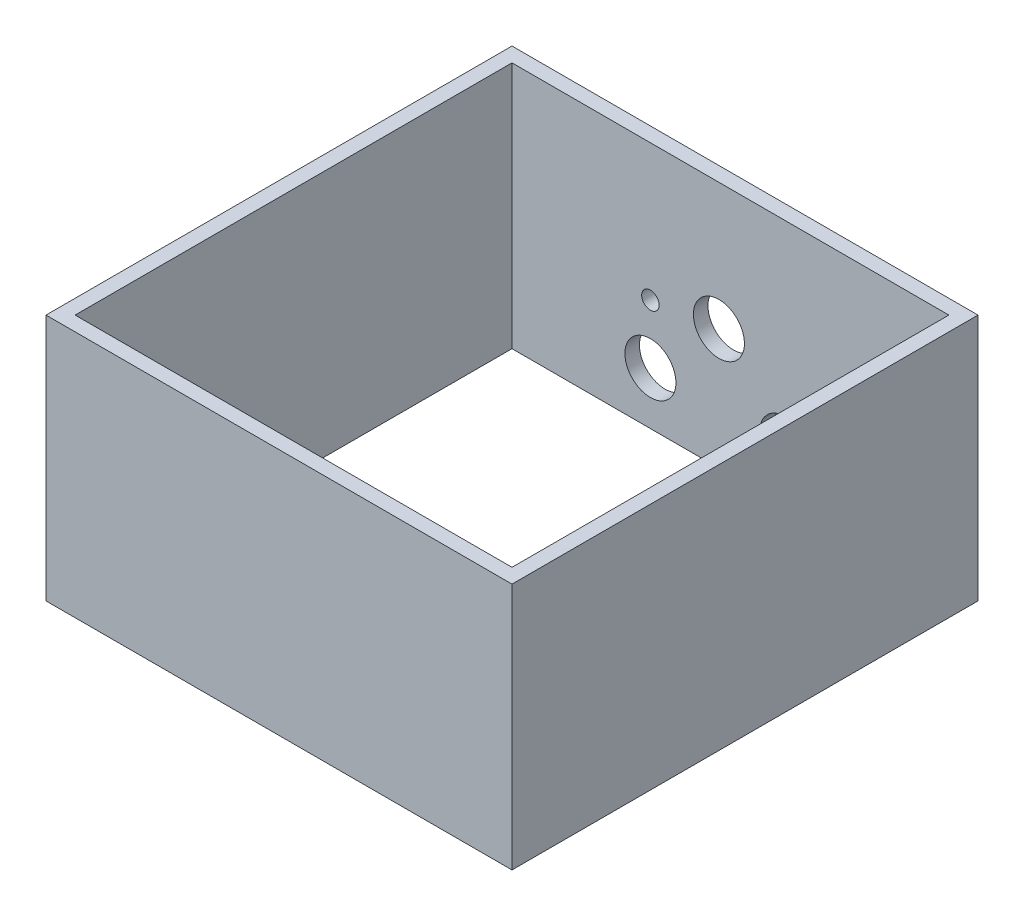
ISO-10303-21;
HEADER;
FILE_DESCRIPTION(('STEP AP214'),'2;1');
FILE_NAME('part.step','',(''),(''),'','','');
FILE_SCHEMA(('AUTOMOTIVE_DESIGN { 1 0 10303 214 1 1 1 1 }'));
ENDSEC;
DATA;
#1=APPLICATION_CONTEXT('core data for automotive mechanical design processes');
#2=APPLICATION_PROTOCOL_DEFINITION('international standard','automotive_design',2000,#1);
#3=PRODUCT_CONTEXT('',#1,'mechanical');
#4=PRODUCT('Part','Part','',(#3));
#5=PRODUCT_RELATED_PRODUCT_CATEGORY('part','',(#4));
#6=PRODUCT_DEFINITION_FORMATION('','',#4);
#7=PRODUCT_DEFINITION_CONTEXT('part definition',#1,'design');
#8=PRODUCT_DEFINITION('design','',#6,#7);
#9=PRODUCT_DEFINITION_SHAPE('','',#8);
#10=(LENGTH_UNIT() NAMED_UNIT(*) SI_UNIT(.MILLI.,.METRE.));
#11=(NAMED_UNIT(*) PLANE_ANGLE_UNIT() SI_UNIT($,.RADIAN.));
#12=(NAMED_UNIT(*) SI_UNIT($,.STERADIAN.) SOLID_ANGLE_UNIT());
#13=UNCERTAINTY_MEASURE_WITH_UNIT(LENGTH_MEASURE(1.E-05),#10,'distance_accuracy_value','');
#14=(GEOMETRIC_REPRESENTATION_CONTEXT(3) GLOBAL_UNCERTAINTY_ASSIGNED_CONTEXT((#13)) GLOBAL_UNIT_ASSIGNED_CONTEXT((#10,
#11,#12)) REPRESENTATION_CONTEXT('',''));
#15=CARTESIAN_POINT('',(0.,0.,0.));
#16=DIRECTION('',(0.,0.,1.));
#17=DIRECTION('',(1.,0.,0.));
#18=AXIS2_PLACEMENT_3D('',#15,#16,#17);
#19=CARTESIAN_POINT('',(0.,53.975,0.));
#20=DIRECTION('',(0.,-1.,0.));
#21=DIRECTION('',(0.,0.,-1.));
#22=AXIS2_PLACEMENT_3D('',#19,#20,#21);
#23=PLANE('',#22);
#24=DIRECTION('',(0.,0.,-1.));
#25=VECTOR('',#24,1.);
#26=CARTESIAN_POINT('',(50.8,53.975,50.8));
#27=LINE('',#26,#25);
#28=CARTESIAN_POINT('',(50.8,53.975,50.8));
#29=VERTEX_POINT('',#28);
#30=CARTESIAN_POINT('',(50.8,53.975,-50.8));
#31=VERTEX_POINT('',#30);
#32=EDGE_CURVE('E136',#29,#31,#27,.T.);
#33=ORIENTED_EDGE('',*,*,#32,.T.);
#34=DIRECTION('',(-1.,0.,0.));
#35=VECTOR('',#34,1.);
#36=CARTESIAN_POINT('',(-50.8,53.975,-50.8));
#37=LINE('',#36,#35);
#38=CARTESIAN_POINT('',(-50.8,53.975,-50.8));
#39=VERTEX_POINT('',#38);
#40=EDGE_CURVE('E139',#31,#39,#37,.T.);
#41=ORIENTED_EDGE('',*,*,#40,.T.);
#42=DIRECTION('',(0.,0.,1.));
#43=VECTOR('',#42,1.);
#44=CARTESIAN_POINT('',(-50.8,53.975,50.8));
#45=LINE('',#44,#43);
#46=CARTESIAN_POINT('',(-50.8,53.975,50.8));
#47=VERTEX_POINT('',#46);
#48=EDGE_CURVE('E142',#39,#47,#45,.T.);
#49=ORIENTED_EDGE('',*,*,#48,.T.);
#50=DIRECTION('',(1.,0.,0.));
#51=VECTOR('',#50,1.);
#52=CARTESIAN_POINT('',(-50.8,53.975,50.8));
#53=LINE('',#52,#51);
#54=EDGE_CURVE('E144',#47,#29,#53,.T.);
#55=ORIENTED_EDGE('',*,*,#54,.T.);
#56=EDGE_LOOP('',(#33,#41,#49,#55));
#57=FACE_BOUND('',#56,.T.);
#58=DIRECTION('',(0.,0.,1.));
#59=VECTOR('',#58,1.);
#60=CARTESIAN_POINT('',(-47.625,53.975,47.625));
#61=LINE('',#60,#59);
#62=CARTESIAN_POINT('',(-47.625,53.975,-47.625));
#63=VERTEX_POINT('',#62);
#64=CARTESIAN_POINT('',(-47.625,53.975,47.625));
#65=VERTEX_POINT('',#64);
#66=EDGE_CURVE('E98',#63,#65,#61,.T.);
#67=ORIENTED_EDGE('',*,*,#66,.F.);
#68=DIRECTION('',(-1.,0.,0.));
#69=VECTOR('',#68,1.);
#70=CARTESIAN_POINT('',(-47.625,53.975,-47.625));
#71=LINE('',#70,#69);
#72=CARTESIAN_POINT('',(47.625,53.975,-47.625));
#73=VERTEX_POINT('',#72);
#74=EDGE_CURVE('E120',#73,#63,#71,.T.);
#75=ORIENTED_EDGE('',*,*,#74,.F.);
#76=DIRECTION('',(0.,0.,-1.));
#77=VECTOR('',#76,1.);
#78=CARTESIAN_POINT('',(47.625,53.975,47.625));
#79=LINE('',#78,#77);
#80=CARTESIAN_POINT('',(47.625,53.975,47.625));
#81=VERTEX_POINT('',#80);
#82=EDGE_CURVE('E118',#81,#73,#79,.T.);
#83=ORIENTED_EDGE('',*,*,#82,.F.);
#84=DIRECTION('',(1.,0.,0.));
#85=VECTOR('',#84,1.);
#86=CARTESIAN_POINT('',(-47.625,53.975,47.625));
#87=LINE('',#86,#85);
#88=EDGE_CURVE('E106',#65,#81,#87,.T.);
#89=ORIENTED_EDGE('',*,*,#88,.F.);
#90=EDGE_LOOP('',(#67,#75,#83,#89));
#91=FACE_BOUND('',#90,.T.);
#92=ADVANCED_FACE('F33',(#57,#91),#23,.F.);
#93=CARTESIAN_POINT('',(0.,0.,0.));
#94=DIRECTION('',(0.,-1.,0.));
#95=DIRECTION('',(0.,0.,-1.));
#96=AXIS2_PLACEMENT_3D('',#93,#94,#95);
#97=PLANE('',#96);
#98=DIRECTION('',(0.,0.,-1.));
#99=VECTOR('',#98,1.);
#100=CARTESIAN_POINT('',(50.8,0.,50.8));
#101=LINE('',#100,#99);
#102=CARTESIAN_POINT('',(50.8,0.,50.8));
#103=VERTEX_POINT('',#102);
#104=CARTESIAN_POINT('',(50.8,0.,-50.8));
#105=VERTEX_POINT('',#104);
#106=EDGE_CURVE('E114',#103,#105,#101,.T.);
#107=ORIENTED_EDGE('',*,*,#106,.F.);
#108=DIRECTION('',(1.,0.,0.));
#109=VECTOR('',#108,1.);
#110=CARTESIAN_POINT('',(-50.8,0.,50.8));
#111=LINE('',#110,#109);
#112=CARTESIAN_POINT('',(-50.8,0.,50.8));
#113=VERTEX_POINT('',#112);
#114=EDGE_CURVE('E140',#113,#103,#111,.T.);
#115=ORIENTED_EDGE('',*,*,#114,.F.);
#116=DIRECTION('',(0.,0.,1.));
#117=VECTOR('',#116,1.);
#118=CARTESIAN_POINT('',(-50.8,0.,50.8));
#119=LINE('',#118,#117);
#120=CARTESIAN_POINT('',(-50.8,0.,-50.8));
#121=VERTEX_POINT('',#120);
#122=EDGE_CURVE('E151',#121,#113,#119,.T.);
#123=ORIENTED_EDGE('',*,*,#122,.F.);
#124=DIRECTION('',(-1.,0.,0.));
#125=VECTOR('',#124,1.);
#126=CARTESIAN_POINT('',(-50.8,0.,-50.8));
#127=LINE('',#126,#125);
#128=EDGE_CURVE('E149',#105,#121,#127,.T.);
#129=ORIENTED_EDGE('',*,*,#128,.F.);
#130=EDGE_LOOP('',(#107,#115,#123,#129));
#131=FACE_BOUND('',#130,.T.);
#132=DIRECTION('',(-1.,0.,0.));
#133=VECTOR('',#132,1.);
#134=CARTESIAN_POINT('',(-47.625,0.,-47.625));
#135=LINE('',#134,#133);
#136=CARTESIAN_POINT('',(47.625,0.,-47.625));
#137=VERTEX_POINT('',#136);
#138=CARTESIAN_POINT('',(-47.625,0.,-47.625));
#139=VERTEX_POINT('',#138);
#140=EDGE_CURVE('E107',#137,#139,#135,.T.);
#141=ORIENTED_EDGE('',*,*,#140,.T.);
#142=DIRECTION('',(0.,0.,1.));
#143=VECTOR('',#142,1.);
#144=CARTESIAN_POINT('',(-47.625,0.,47.625));
#145=LINE('',#144,#143);
#146=CARTESIAN_POINT('',(-47.625,0.,47.625));
#147=VERTEX_POINT('',#146);
#148=EDGE_CURVE('E56',#139,#147,#145,.T.);
#149=ORIENTED_EDGE('',*,*,#148,.T.);
#150=DIRECTION('',(1.,0.,0.));
#151=VECTOR('',#150,1.);
#152=CARTESIAN_POINT('',(-47.625,0.,47.625));
#153=LINE('',#152,#151);
#154=CARTESIAN_POINT('',(47.625,0.,47.625));
#155=VERTEX_POINT('',#154);
#156=EDGE_CURVE('E113',#147,#155,#153,.T.);
#157=ORIENTED_EDGE('',*,*,#156,.T.);
#158=DIRECTION('',(0.,0.,-1.));
#159=VECTOR('',#158,1.);
#160=CARTESIAN_POINT('',(47.625,0.,47.625));
#161=LINE('',#160,#159);
#162=EDGE_CURVE('E128',#155,#137,#161,.T.);
#163=ORIENTED_EDGE('',*,*,#162,.T.);
#164=EDGE_LOOP('',(#141,#149,#157,#163));
#165=FACE_BOUND('',#164,.T.);
#166=ADVANCED_FACE('F169',(#131,#165),#97,.T.);
#167=CARTESIAN_POINT('',(50.8,53.975,50.8));
#168=DIRECTION('',(-1.,0.,0.));
#169=DIRECTION('',(0.,0.,1.));
#170=AXIS2_PLACEMENT_3D('',#167,#168,#169);
#171=PLANE('',#170);
#172=ORIENTED_EDGE('',*,*,#106,.T.);
#173=DIRECTION('',(0.,-1.,0.));
#174=VECTOR('',#173,1.);
#175=CARTESIAN_POINT('',(50.8,53.975,-50.8));
#176=LINE('',#175,#174);
#177=EDGE_CURVE('E11',#31,#105,#176,.T.);
#178=ORIENTED_EDGE('',*,*,#177,.F.);
#179=ORIENTED_EDGE('',*,*,#32,.F.);
#180=DIRECTION('',(0.,-1.,0.));
#181=VECTOR('',#180,1.);
#182=CARTESIAN_POINT('',(50.8,53.975,50.8));
#183=LINE('',#182,#181);
#184=EDGE_CURVE('E146',#29,#103,#183,.T.);
#185=ORIENTED_EDGE('',*,*,#184,.T.);
#186=EDGE_LOOP('',(#172,#178,#179,#185));
#187=FACE_BOUND('',#186,.T.);
#188=ADVANCED_FACE('F35',(#187),#171,.F.);
#189=CARTESIAN_POINT('',(-50.8,53.975,-50.8));
#190=DIRECTION('',(0.,0.,1.));
#191=DIRECTION('',(1.,0.,0.));
#192=AXIS2_PLACEMENT_3D('',#189,#190,#191);
#193=PLANE('',#192);
#194=CARTESIAN_POINT('',(-17.4498,24.257,-50.8));
#195=DIRECTION('',(0.,0.,-1.));
#196=DIRECTION('',(-1.,0.,0.));
#197=AXIS2_PLACEMENT_3D('',#194,#195,#196);
#198=CIRCLE('',#197,1.905);
#199=CARTESIAN_POINT('',(-19.3548,24.257,-50.8));
#200=VERTEX_POINT('',#199);
#201=EDGE_CURVE('E262',#200,#200,#198,.T.);
#202=ORIENTED_EDGE('',*,*,#201,.F.);
#203=EDGE_LOOP('',(#202));
#204=FACE_BOUND('',#203,.T.);
#205=CARTESIAN_POINT('',(-17.4498,11.43,-50.8));
#206=DIRECTION('',(0.,0.,-1.));
#207=DIRECTION('',(-1.,0.,0.));
#208=AXIS2_PLACEMENT_3D('',#205,#206,#207);
#209=CIRCLE('',#208,5.5626);
#210=CARTESIAN_POINT('',(-23.0124,11.43,-50.8));
#211=VERTEX_POINT('',#210);
#212=EDGE_CURVE('E256',#211,#211,#209,.T.);
#213=ORIENTED_EDGE('',*,*,#212,.F.);
#214=EDGE_LOOP('',(#213));
#215=FACE_BOUND('',#214,.T.);
#216=CARTESIAN_POINT('',(11.9634,11.43,-50.8));
#217=DIRECTION('',(0.,0.,-1.));
#218=DIRECTION('',(-1.,0.,0.));
#219=AXIS2_PLACEMENT_3D('',#216,#217,#218);
#220=CIRCLE('',#219,5.5626);
#221=CARTESIAN_POINT('',(6.4008,11.43,-50.8));
#222=VERTEX_POINT('',#221);
#223=EDGE_CURVE('E248',#222,#222,#220,.T.);
#224=ORIENTED_EDGE('',*,*,#223,.F.);
#225=EDGE_LOOP('',(#224));
#226=FACE_BOUND('',#225,.T.);
#227=CARTESIAN_POINT('',(23.5204,24.257,-50.8));
#228=DIRECTION('',(0.,0.,-1.));
#229=DIRECTION('',(-1.,0.,0.));
#230=AXIS2_PLACEMENT_3D('',#227,#228,#229);
#231=CIRCLE('',#230,1.905);
#232=CARTESIAN_POINT('',(21.6154,24.257,-50.8));
#233=VERTEX_POINT('',#232);
#234=EDGE_CURVE('E243',#233,#233,#231,.T.);
#235=ORIENTED_EDGE('',*,*,#234,.F.);
#236=EDGE_LOOP('',(#235));
#237=FACE_BOUND('',#236,.T.);
#238=CARTESIAN_POINT('',(-2.51459999999999,26.289,-50.8));
#239=DIRECTION('',(0.,0.,-1.));
#240=DIRECTION('',(-1.,0.,0.));
#241=AXIS2_PLACEMENT_3D('',#238,#239,#240);
#242=CIRCLE('',#241,5.5626);
#243=CARTESIAN_POINT('',(-8.07719999999999,26.289,-50.8));
#244=VERTEX_POINT('',#243);
#245=EDGE_CURVE('E126',#244,#244,#242,.T.);
#246=ORIENTED_EDGE('',*,*,#245,.F.);
#247=EDGE_LOOP('',(#246));
#248=FACE_BOUND('',#247,.T.);
#249=ORIENTED_EDGE('',*,*,#128,.T.);
#250=DIRECTION('',(0.,-1.,0.));
#251=VECTOR('',#250,1.);
#252=CARTESIAN_POINT('',(-50.8,53.975,-50.8));
#253=LINE('',#252,#251);
#254=EDGE_CURVE('E41',#39,#121,#253,.T.);
#255=ORIENTED_EDGE('',*,*,#254,.F.);
#256=ORIENTED_EDGE('',*,*,#40,.F.);
#257=ORIENTED_EDGE('',*,*,#177,.T.);
#258=EDGE_LOOP('',(#249,#255,#256,#257));
#259=FACE_BOUND('',#258,.T.);
#260=ADVANCED_FACE('F179',(#204,#215,#226,#237,#248,#259),#193,.F.);
#261=CARTESIAN_POINT('',(-50.8,53.975,50.8));
#262=DIRECTION('',(1.,0.,0.));
#263=DIRECTION('',(0.,0.,-1.));
#264=AXIS2_PLACEMENT_3D('',#261,#262,#263);
#265=PLANE('',#264);
#266=ORIENTED_EDGE('',*,*,#122,.T.);
#267=DIRECTION('',(0.,-1.,0.));
#268=VECTOR('',#267,1.);
#269=CARTESIAN_POINT('',(-50.8,53.975,50.8));
#270=LINE('',#269,#268);
#271=EDGE_CURVE('E156',#47,#113,#270,.T.);
#272=ORIENTED_EDGE('',*,*,#271,.F.);
#273=ORIENTED_EDGE('',*,*,#48,.F.);
#274=ORIENTED_EDGE('',*,*,#254,.T.);
#275=EDGE_LOOP('',(#266,#272,#273,#274));
#276=FACE_BOUND('',#275,.T.);
#277=ADVANCED_FACE('F163',(#276),#265,.F.);
#278=CARTESIAN_POINT('',(-50.8,53.975,50.8));
#279=DIRECTION('',(0.,0.,-1.));
#280=DIRECTION('',(-1.,0.,0.));
#281=AXIS2_PLACEMENT_3D('',#278,#279,#280);
#282=PLANE('',#281);
#283=ORIENTED_EDGE('',*,*,#114,.T.);
#284=ORIENTED_EDGE('',*,*,#184,.F.);
#285=ORIENTED_EDGE('',*,*,#54,.F.);
#286=ORIENTED_EDGE('',*,*,#271,.T.);
#287=EDGE_LOOP('',(#283,#284,#285,#286));
#288=FACE_BOUND('',#287,.T.);
#289=ADVANCED_FACE('F173',(#288),#282,.F.);
#290=CARTESIAN_POINT('',(-47.625,53.975,47.625));
#291=DIRECTION('',(1.,0.,0.));
#292=DIRECTION('',(0.,0.,-1.));
#293=AXIS2_PLACEMENT_3D('',#290,#291,#292);
#294=PLANE('',#293);
#295=ORIENTED_EDGE('',*,*,#148,.F.);
#296=DIRECTION('',(0.,-1.,0.));
#297=VECTOR('',#296,1.);
#298=CARTESIAN_POINT('',(-47.625,53.975,-47.625));
#299=LINE('',#298,#297);
#300=EDGE_CURVE('E102',#63,#139,#299,.T.);
#301=ORIENTED_EDGE('',*,*,#300,.F.);
#302=ORIENTED_EDGE('',*,*,#66,.T.);
#303=DIRECTION('',(0.,-1.,0.));
#304=VECTOR('',#303,1.);
#305=CARTESIAN_POINT('',(-47.625,53.975,47.625));
#306=LINE('',#305,#304);
#307=EDGE_CURVE('E101',#65,#147,#306,.T.);
#308=ORIENTED_EDGE('',*,*,#307,.T.);
#309=EDGE_LOOP('',(#295,#301,#302,#308));
#310=FACE_BOUND('',#309,.T.);
#311=ADVANCED_FACE('F100',(#310),#294,.T.);
#312=CARTESIAN_POINT('',(-47.625,53.975,47.625));
#313=DIRECTION('',(0.,0.,-1.));
#314=DIRECTION('',(-1.,0.,0.));
#315=AXIS2_PLACEMENT_3D('',#312,#313,#314);
#316=PLANE('',#315);
#317=ORIENTED_EDGE('',*,*,#156,.F.);
#318=ORIENTED_EDGE('',*,*,#307,.F.);
#319=ORIENTED_EDGE('',*,*,#88,.T.);
#320=DIRECTION('',(0.,-1.,0.));
#321=VECTOR('',#320,1.);
#322=CARTESIAN_POINT('',(47.625,53.975,47.625));
#323=LINE('',#322,#321);
#324=EDGE_CURVE('E115',#81,#155,#323,.T.);
#325=ORIENTED_EDGE('',*,*,#324,.T.);
#326=EDGE_LOOP('',(#317,#318,#319,#325));
#327=FACE_BOUND('',#326,.T.);
#328=ADVANCED_FACE('F110',(#327),#316,.T.);
#329=CARTESIAN_POINT('',(47.625,53.975,47.625));
#330=DIRECTION('',(-1.,0.,0.));
#331=DIRECTION('',(0.,0.,1.));
#332=AXIS2_PLACEMENT_3D('',#329,#330,#331);
#333=PLANE('',#332);
#334=ORIENTED_EDGE('',*,*,#162,.F.);
#335=ORIENTED_EDGE('',*,*,#324,.F.);
#336=ORIENTED_EDGE('',*,*,#82,.T.);
#337=DIRECTION('',(0.,-1.,0.));
#338=VECTOR('',#337,1.);
#339=CARTESIAN_POINT('',(47.625,53.975,-47.625));
#340=LINE('',#339,#338);
#341=EDGE_CURVE('E48',#73,#137,#340,.T.);
#342=ORIENTED_EDGE('',*,*,#341,.T.);
#343=EDGE_LOOP('',(#334,#335,#336,#342));
#344=FACE_BOUND('',#343,.T.);
#345=ADVANCED_FACE('F205',(#344),#333,.T.);
#346=CARTESIAN_POINT('',(-47.625,53.975,-47.625));
#347=DIRECTION('',(0.,0.,1.));
#348=DIRECTION('',(1.,0.,0.));
#349=AXIS2_PLACEMENT_3D('',#346,#347,#348);
#350=PLANE('',#349);
#351=CARTESIAN_POINT('',(-17.4498,24.257,-47.625));
#352=DIRECTION('',(0.,0.,1.));
#353=DIRECTION('',(1.,0.,0.));
#354=AXIS2_PLACEMENT_3D('',#351,#352,#353);
#355=CIRCLE('',#354,1.905);
#356=CARTESIAN_POINT('',(-15.5448,24.257,-47.625));
#357=VERTEX_POINT('',#356);
#358=EDGE_CURVE('E265',#357,#357,#355,.F.);
#359=ORIENTED_EDGE('',*,*,#358,.T.);
#360=EDGE_LOOP('',(#359));
#361=FACE_BOUND('',#360,.T.);
#362=CARTESIAN_POINT('',(-17.4498,11.43,-47.625));
#363=DIRECTION('',(0.,0.,1.));
#364=DIRECTION('',(1.,0.,0.));
#365=AXIS2_PLACEMENT_3D('',#362,#363,#364);
#366=CIRCLE('',#365,5.5626);
#367=CARTESIAN_POINT('',(-11.8872,11.43,-47.625));
#368=VERTEX_POINT('',#367);
#369=EDGE_CURVE('E259',#368,#368,#366,.F.);
#370=ORIENTED_EDGE('',*,*,#369,.T.);
#371=EDGE_LOOP('',(#370));
#372=FACE_BOUND('',#371,.T.);
#373=CARTESIAN_POINT('',(11.9634,11.43,-47.625));
#374=DIRECTION('',(0.,0.,1.));
#375=DIRECTION('',(1.,0.,0.));
#376=AXIS2_PLACEMENT_3D('',#373,#374,#375);
#377=CIRCLE('',#376,5.5626);
#378=CARTESIAN_POINT('',(17.526,11.43,-47.625));
#379=VERTEX_POINT('',#378);
#380=EDGE_CURVE('E253',#379,#379,#377,.F.);
#381=ORIENTED_EDGE('',*,*,#380,.T.);
#382=EDGE_LOOP('',(#381));
#383=FACE_BOUND('',#382,.T.);
#384=CARTESIAN_POINT('',(23.5204,24.257,-47.625));
#385=DIRECTION('',(0.,0.,1.));
#386=DIRECTION('',(1.,0.,0.));
#387=AXIS2_PLACEMENT_3D('',#384,#385,#386);
#388=CIRCLE('',#387,1.905);
#389=CARTESIAN_POINT('',(25.4254,24.257,-47.625));
#390=VERTEX_POINT('',#389);
#391=EDGE_CURVE('E240',#390,#390,#388,.F.);
#392=ORIENTED_EDGE('',*,*,#391,.T.);
#393=EDGE_LOOP('',(#392));
#394=FACE_BOUND('',#393,.T.);
#395=CARTESIAN_POINT('',(-2.51459999999999,26.289,-47.625));
#396=DIRECTION('',(0.,0.,1.));
#397=DIRECTION('',(1.,0.,0.));
#398=AXIS2_PLACEMENT_3D('',#395,#396,#397);
#399=CIRCLE('',#398,5.5626);
#400=CARTESIAN_POINT('',(3.04800000000001,26.289,-47.625));
#401=VERTEX_POINT('',#400);
#402=EDGE_CURVE('E245',#401,#401,#399,.F.);
#403=ORIENTED_EDGE('',*,*,#402,.T.);
#404=EDGE_LOOP('',(#403));
#405=FACE_BOUND('',#404,.T.);
#406=ORIENTED_EDGE('',*,*,#140,.F.);
#407=ORIENTED_EDGE('',*,*,#341,.F.);
#408=ORIENTED_EDGE('',*,*,#74,.T.);
#409=ORIENTED_EDGE('',*,*,#300,.T.);
#410=EDGE_LOOP('',(#406,#407,#408,#409));
#411=FACE_BOUND('',#410,.T.);
#412=ADVANCED_FACE('F209',(#361,#372,#383,#394,#405,#411),#350,.T.);
#413=CARTESIAN_POINT('',(-2.51459999999999,26.289,50.801));
#414=DIRECTION('',(0.,0.,-1.));
#415=DIRECTION('',(-1.,0.,0.));
#416=AXIS2_PLACEMENT_3D('',#413,#414,#415);
#417=CYLINDRICAL_SURFACE('',#416,5.5626);
#418=ORIENTED_EDGE('',*,*,#402,.F.);
#419=EDGE_LOOP('',(#418));
#420=FACE_BOUND('',#419,.T.);
#421=ORIENTED_EDGE('',*,*,#245,.T.);
#422=EDGE_LOOP('',(#421));
#423=FACE_BOUND('',#422,.T.);
#424=ADVANCED_FACE('F215',(#420,#423),#417,.F.);
#425=CARTESIAN_POINT('',(23.5204,24.257,50.801));
#426=DIRECTION('',(0.,0.,-1.));
#427=DIRECTION('',(-1.,0.,0.));
#428=AXIS2_PLACEMENT_3D('',#425,#426,#427);
#429=CYLINDRICAL_SURFACE('',#428,1.905);
#430=ORIENTED_EDGE('',*,*,#391,.F.);
#431=EDGE_LOOP('',(#430));
#432=FACE_BOUND('',#431,.T.);
#433=ORIENTED_EDGE('',*,*,#234,.T.);
#434=EDGE_LOOP('',(#433));
#435=FACE_BOUND('',#434,.T.);
#436=ADVANCED_FACE('F219',(#432,#435),#429,.F.);
#437=CARTESIAN_POINT('',(11.9634,11.43,50.801));
#438=DIRECTION('',(0.,0.,-1.));
#439=DIRECTION('',(-1.,0.,0.));
#440=AXIS2_PLACEMENT_3D('',#437,#438,#439);
#441=CYLINDRICAL_SURFACE('',#440,5.5626);
#442=ORIENTED_EDGE('',*,*,#380,.F.);
#443=EDGE_LOOP('',(#442));
#444=FACE_BOUND('',#443,.T.);
#445=ORIENTED_EDGE('',*,*,#223,.T.);
#446=EDGE_LOOP('',(#445));
#447=FACE_BOUND('',#446,.T.);
#448=ADVANCED_FACE('F228',(#444,#447),#441,.F.);
#449=CARTESIAN_POINT('',(-17.4498,11.43,50.801));
#450=DIRECTION('',(0.,0.,-1.));
#451=DIRECTION('',(-1.,0.,0.));
#452=AXIS2_PLACEMENT_3D('',#449,#450,#451);
#453=CYLINDRICAL_SURFACE('',#452,5.5626);
#454=ORIENTED_EDGE('',*,*,#369,.F.);
#455=EDGE_LOOP('',(#454));
#456=FACE_BOUND('',#455,.T.);
#457=ORIENTED_EDGE('',*,*,#212,.T.);
#458=EDGE_LOOP('',(#457));
#459=FACE_BOUND('',#458,.T.);
#460=ADVANCED_FACE('F224',(#456,#459),#453,.F.);
#461=CARTESIAN_POINT('',(-17.4498,24.257,50.801));
#462=DIRECTION('',(0.,0.,-1.));
#463=DIRECTION('',(-1.,0.,0.));
#464=AXIS2_PLACEMENT_3D('',#461,#462,#463);
#465=CYLINDRICAL_SURFACE('',#464,1.905);
#466=ORIENTED_EDGE('',*,*,#358,.F.);
#467=EDGE_LOOP('',(#466));
#468=FACE_BOUND('',#467,.T.);
#469=ORIENTED_EDGE('',*,*,#201,.T.);
#470=EDGE_LOOP('',(#469));
#471=FACE_BOUND('',#470,.T.);
#472=ADVANCED_FACE('F221',(#468,#471),#465,.F.);
#473=CLOSED_SHELL('',(#92,#166,#188,#260,#277,#289,#311,#328,#345,#412,#424,#436,#448,#460,#472));
#474=MANIFOLD_SOLID_BREP('B2',#473);
#475=ADVANCED_BREP_SHAPE_REPRESENTATION('',(#18,#474),#14);
#476=SHAPE_DEFINITION_REPRESENTATION(#9,#475);
ENDSEC;
END-ISO-10303-21;
